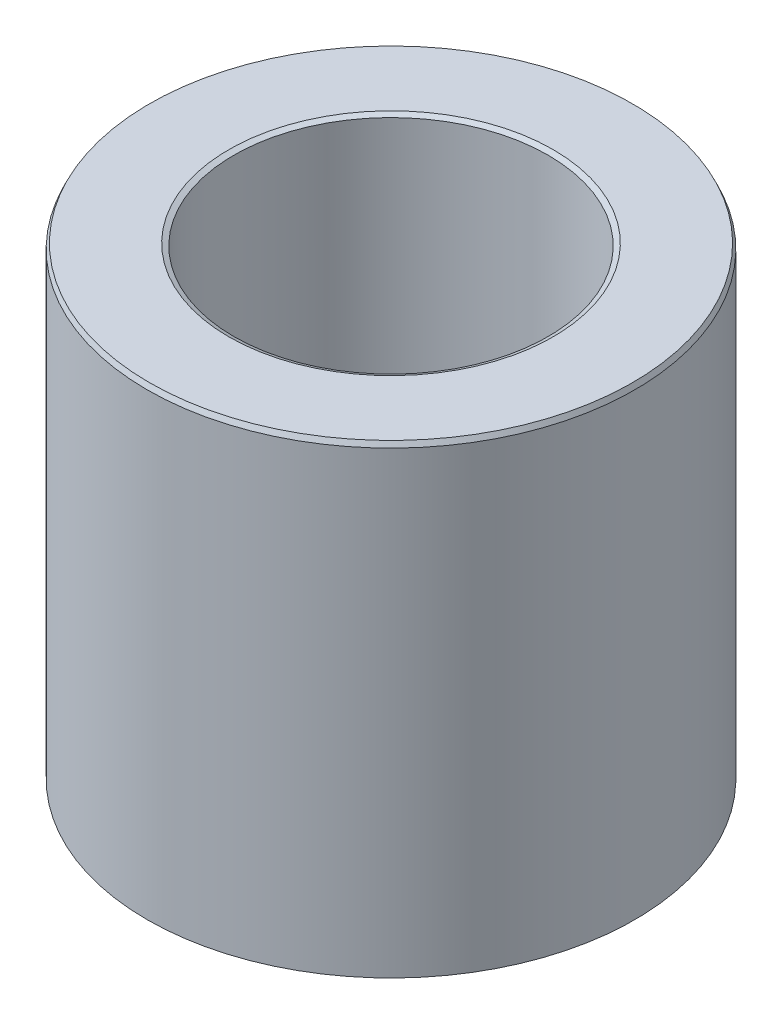
ISO-10303-21;
HEADER;
FILE_DESCRIPTION(('STEP AP214'),'2;1');
FILE_NAME('part.step','',(''),(''),'','','');
FILE_SCHEMA(('AUTOMOTIVE_DESIGN { 1 0 10303 214 1 1 1 1 }'));
ENDSEC;
DATA;
#1=APPLICATION_CONTEXT('core data for automotive mechanical design processes');
#2=APPLICATION_PROTOCOL_DEFINITION('international standard','automotive_design',2000,#1);
#3=PRODUCT_CONTEXT('',#1,'mechanical');
#4=PRODUCT('Part','Part','',(#3));
#5=PRODUCT_RELATED_PRODUCT_CATEGORY('part','',(#4));
#6=PRODUCT_DEFINITION_FORMATION('','',#4);
#7=PRODUCT_DEFINITION_CONTEXT('part definition',#1,'design');
#8=PRODUCT_DEFINITION('design','',#6,#7);
#9=PRODUCT_DEFINITION_SHAPE('','',#8);
#10=(LENGTH_UNIT() NAMED_UNIT(*) SI_UNIT(.MILLI.,.METRE.));
#11=(NAMED_UNIT(*) PLANE_ANGLE_UNIT() SI_UNIT($,.RADIAN.));
#12=(NAMED_UNIT(*) SI_UNIT($,.STERADIAN.) SOLID_ANGLE_UNIT());
#13=UNCERTAINTY_MEASURE_WITH_UNIT(LENGTH_MEASURE(1.E-05),#10,'distance_accuracy_value','');
#14=(GEOMETRIC_REPRESENTATION_CONTEXT(3) GLOBAL_UNCERTAINTY_ASSIGNED_CONTEXT((#13)) GLOBAL_UNIT_ASSIGNED_CONTEXT((#10,
#11,#12)) REPRESENTATION_CONTEXT('',''));
#15=CARTESIAN_POINT('',(0.,0.,0.));
#16=DIRECTION('',(0.,0.,1.));
#17=DIRECTION('',(1.,0.,0.));
#18=AXIS2_PLACEMENT_3D('',#15,#16,#17);
#19=CARTESIAN_POINT('',(0.,71.7025831738395,0.));
#20=DIRECTION('',(0.,-1.,0.));
#21=DIRECTION('',(0.,0.,-1.));
#22=AXIS2_PLACEMENT_3D('',#19,#20,#21);
#23=CYLINDRICAL_SURFACE('',#22,37.5);
#24=CARTESIAN_POINT('',(0.,0.352131170768377,0.));
#25=DIRECTION('',(0.,1.,0.));
#26=DIRECTION('',(0.,0.,1.));
#27=AXIS2_PLACEMENT_3D('',#24,#25,#26);
#28=CIRCLE('',#27,37.5);
#29=CARTESIAN_POINT('',(0.,0.352131170768377,37.5));
#30=VERTEX_POINT('',#29);
#31=EDGE_CURVE('E10',#30,#30,#28,.T.);
#32=ORIENTED_EDGE('',*,*,#31,.T.);
#33=EDGE_LOOP('',(#32));
#34=FACE_BOUND('',#33,.T.);
#35=CARTESIAN_POINT('',(0.,70.9270093020458,0.));
#36=DIRECTION('',(0.,1.,0.));
#37=DIRECTION('',(0.,0.,1.));
#38=AXIS2_PLACEMENT_3D('',#35,#36,#37);
#39=CIRCLE('',#38,37.5);
#40=CARTESIAN_POINT('',(0.,70.9270093020458,37.5));
#41=VERTEX_POINT('',#40);
#42=EDGE_CURVE('E50',#41,#41,#39,.F.);
#43=ORIENTED_EDGE('',*,*,#42,.T.);
#44=EDGE_LOOP('',(#43));
#45=FACE_BOUND('',#44,.T.);
#46=ADVANCED_FACE('F39',(#34,#45),#23,.T.);
#47=CARTESIAN_POINT('',(0.,71.7025831738395,0.));
#48=DIRECTION('',(0.,1.,0.));
#49=DIRECTION('',(0.,0.,1.));
#50=AXIS2_PLACEMENT_3D('',#47,#48,#49);
#51=PLANE('',#50);
#52=CARTESIAN_POINT('',(0.,71.7025831738395,0.));
#53=DIRECTION('',(0.,1.,0.));
#54=DIRECTION('',(0.,0.,1.));
#55=AXIS2_PLACEMENT_3D('',#52,#53,#54);
#56=CIRCLE('',#55,24.941851325434);
#57=CARTESIAN_POINT('',(0.,71.7025831738395,24.941851325434));
#58=VERTEX_POINT('',#57);
#59=EDGE_CURVE('E58',#58,#58,#56,.F.);
#60=ORIENTED_EDGE('',*,*,#59,.T.);
#61=EDGE_LOOP('',(#60));
#62=FACE_BOUND('',#61,.T.);
#63=CARTESIAN_POINT('',(0.,71.7025831738395,0.));
#64=DIRECTION('',(0.,1.,0.));
#65=DIRECTION('',(0.,0.,1.));
#66=AXIS2_PLACEMENT_3D('',#63,#64,#65);
#67=CIRCLE('',#66,37.1478688292316);
#68=CARTESIAN_POINT('',(0.,71.7025831738395,37.1478688292316));
#69=VERTEX_POINT('',#68);
#70=EDGE_CURVE('E61',#69,#69,#67,.T.);
#71=ORIENTED_EDGE('',*,*,#70,.T.);
#72=EDGE_LOOP('',(#71));
#73=FACE_BOUND('',#72,.T.);
#74=ADVANCED_FACE('F88',(#62,#73),#51,.T.);
#75=CARTESIAN_POINT('',(0.,0.,0.));
#76=DIRECTION('',(0.,1.,0.));
#77=DIRECTION('',(0.,0.,1.));
#78=AXIS2_PLACEMENT_3D('',#75,#76,#77);
#79=PLANE('',#78);
#80=CARTESIAN_POINT('',(0.,0.,0.));
#81=DIRECTION('',(0.,1.,0.));
#82=DIRECTION('',(0.,0.,1.));
#83=AXIS2_PLACEMENT_3D('',#80,#81,#82);
#84=CIRCLE('',#83,24.5184086244087);
#85=CARTESIAN_POINT('',(0.,0.,-24.5184086244087));
#86=VERTEX_POINT('',#85);
#87=EDGE_CURVE('E51',#86,#86,#84,.T.);
#88=ORIENTED_EDGE('',*,*,#87,.T.);
#89=EDGE_LOOP('',(#88));
#90=FACE_BOUND('',#89,.T.);
#91=CARTESIAN_POINT('',(0.,0.,0.));
#92=DIRECTION('',(0.,1.,0.));
#93=DIRECTION('',(0.,0.,1.));
#94=AXIS2_PLACEMENT_3D('',#91,#92,#93);
#95=CIRCLE('',#94,36.7244261282063);
#96=CARTESIAN_POINT('',(0.,0.,36.7244261282063));
#97=VERTEX_POINT('',#96);
#98=EDGE_CURVE('E54',#97,#97,#95,.F.);
#99=ORIENTED_EDGE('',*,*,#98,.T.);
#100=EDGE_LOOP('',(#99));
#101=FACE_BOUND('',#100,.T.);
#102=ADVANCED_FACE('F83',(#90,#101),#79,.F.);
#103=CARTESIAN_POINT('',(0.,71.7025831738395,0.));
#104=DIRECTION('',(0.,-1.,0.));
#105=DIRECTION('',(0.,0.,-1.));
#106=AXIS2_PLACEMENT_3D('',#103,#104,#105);
#107=CYLINDRICAL_SURFACE('',#106,24.1662774536403);
#108=CARTESIAN_POINT('',(0.,71.3504520030711,0.));
#109=DIRECTION('',(0.,1.,0.));
#110=DIRECTION('',(0.,0.,1.));
#111=AXIS2_PLACEMENT_3D('',#108,#109,#110);
#112=CIRCLE('',#111,24.1662774536403);
#113=CARTESIAN_POINT('',(0.,71.3504520030711,24.1662774536403));
#114=VERTEX_POINT('',#113);
#115=EDGE_CURVE('E67',#114,#114,#112,.T.);
#116=ORIENTED_EDGE('',*,*,#115,.T.);
#117=EDGE_LOOP('',(#116));
#118=FACE_BOUND('',#117,.T.);
#119=CARTESIAN_POINT('',(0.,0.77557387179375,0.));
#120=DIRECTION('',(0.,1.,0.));
#121=DIRECTION('',(0.,0.,1.));
#122=AXIS2_PLACEMENT_3D('',#119,#120,#121);
#123=CIRCLE('',#122,24.1662774536403);
#124=CARTESIAN_POINT('',(0.,0.77557387179375,-24.1662774536403));
#125=VERTEX_POINT('',#124);
#126=EDGE_CURVE('E69',#125,#125,#123,.F.);
#127=ORIENTED_EDGE('',*,*,#126,.T.);
#128=EDGE_LOOP('',(#127));
#129=FACE_BOUND('',#128,.T.);
#130=ADVANCED_FACE('F71',(#118,#129),#107,.F.);
#131=CARTESIAN_POINT('',(0.,71.3504520030711,0.));
#132=DIRECTION('',(0.,1.,0.));
#133=DIRECTION('',(0.,0.,1.));
#134=AXIS2_PLACEMENT_3D('',#131,#132,#133);
#135=CONICAL_SURFACE('',#134,24.1662774536403,1.14459892440019);
#136=ORIENTED_EDGE('',*,*,#59,.F.);
#137=EDGE_LOOP('',(#136));
#138=FACE_BOUND('',#137,.T.);
#139=ORIENTED_EDGE('',*,*,#115,.F.);
#140=EDGE_LOOP('',(#139));
#141=FACE_BOUND('',#140,.T.);
#142=ADVANCED_FACE('F77',(#138,#141),#135,.F.);
#143=CARTESIAN_POINT('',(0.,0.,0.));
#144=DIRECTION('',(0.,-1.,0.));
#145=DIRECTION('',(0.,0.,-1.));
#146=AXIS2_PLACEMENT_3D('',#143,#144,#145);
#147=CONICAL_SURFACE('',#146,24.5184086244087,0.426197402394692);
#148=CARTESIAN_POINT('',(0.,0.77557387179375,-24.1662774536403));
#149=CARTESIAN_POINT('',(0.,0.767494977295898,-24.1699454866692));
#150=CARTESIAN_POINT('',(0.,0.759416082798047,-24.173613519698));
#151=CARTESIAN_POINT('',(0.,0.743258293802344,-24.1809495857557));
#152=CARTESIAN_POINT('',(0.,0.735179399304492,-24.1846176187845));
#153=CARTESIAN_POINT('',(0.,0.719021610308789,-24.1919536848422));
#154=CARTESIAN_POINT('',(0.,0.710942715810937,-24.195621717871));
#155=CARTESIAN_POINT('',(0.,0.694784926815234,-24.2029577839287));
#156=CARTESIAN_POINT('',(0.,0.686706032317382,-24.2066258169575));
#157=CARTESIAN_POINT('',(0.,0.670548243321679,-24.2139618830152));
#158=CARTESIAN_POINT('',(0.,0.662469348823828,-24.2176299160441));
#159=CARTESIAN_POINT('',(0.,0.646311559828125,-24.2249659821017));
#160=CARTESIAN_POINT('',(0.,0.638232665330273,-24.2286340151306));
#161=CARTESIAN_POINT('',(0.,0.62207487633457,-24.2359700811882));
#162=CARTESIAN_POINT('',(0.,0.613995981836719,-24.2396381142171));
#163=CARTESIAN_POINT('',(0.,0.597838192841015,-24.2469741802748));
#164=CARTESIAN_POINT('',(0.,0.589759298343164,-24.2506422133036));
#165=CARTESIAN_POINT('',(0.,0.573601509347461,-24.2579782793613));
#166=CARTESIAN_POINT('',(0.,0.565522614849609,-24.2616463123901));
#167=CARTESIAN_POINT('',(0.,0.549364825853906,-24.2689823784478));
#168=CARTESIAN_POINT('',(0.,0.541285931356055,-24.2726504114766));
#169=CARTESIAN_POINT('',(0.,0.525128142360351,-24.2799864775343));
#170=CARTESIAN_POINT('',(0.,0.5170492478625,-24.2836545105631));
#171=CARTESIAN_POINT('',(0.,0.500891458866797,-24.2909905766208));
#172=CARTESIAN_POINT('',(0.,0.492812564368945,-24.2946586096496));
#173=CARTESIAN_POINT('',(0.,0.476654775373242,-24.3019946757073));
#174=CARTESIAN_POINT('',(0.,0.468575880875391,-24.3056627087362));
#175=CARTESIAN_POINT('',(0.,0.452418091879687,-24.3129987747938));
#176=CARTESIAN_POINT('',(0.,0.444339197381836,-24.3166668078227));
#177=CARTESIAN_POINT('',(0.,0.428181408386133,-24.3240028738803));
#178=CARTESIAN_POINT('',(0.,0.420102513888281,-24.3276709069092));
#179=CARTESIAN_POINT('',(0.,0.403944724892578,-24.3350069729669));
#180=CARTESIAN_POINT('',(0.,0.395865830394726,-24.3386750059957));
#181=CARTESIAN_POINT('',(0.,0.379708041399023,-24.3460110720534));
#182=CARTESIAN_POINT('',(0.,0.371629146901172,-24.3496791050822));
#183=CARTESIAN_POINT('',(0.,0.355471357905469,-24.3570151711399));
#184=CARTESIAN_POINT('',(0.,0.347392463407617,-24.3606832041687));
#185=CARTESIAN_POINT('',(0.,0.331234674411914,-24.3680192702264));
#186=CARTESIAN_POINT('',(0.,0.323155779914062,-24.3716873032552));
#187=CARTESIAN_POINT('',(0.,0.306997990918359,-24.3790233693129));
#188=CARTESIAN_POINT('',(0.,0.298919096420507,-24.3826914023417));
#189=CARTESIAN_POINT('',(0.,0.282761307424804,-24.3900274683994));
#190=CARTESIAN_POINT('',(0.,0.274682412926953,-24.3936955014283));
#191=CARTESIAN_POINT('',(0.,0.25852462393125,-24.4010315674859));
#192=CARTESIAN_POINT('',(0.,0.250445729433398,-24.4046996005148));
#193=CARTESIAN_POINT('',(0.,0.234287940437695,-24.4120356665724));
#194=CARTESIAN_POINT('',(0.,0.226209045939844,-24.4157036996013));
#195=CARTESIAN_POINT('',(0.,0.210051256944141,-24.423039765659));
#196=CARTESIAN_POINT('',(0.,0.201972362446289,-24.4267077986878));
#197=CARTESIAN_POINT('',(0.,0.185814573450586,-24.4340438647455));
#198=CARTESIAN_POINT('',(0.,0.177735678952734,-24.4377118977743));
#199=CARTESIAN_POINT('',(0.,0.161577889957031,-24.445047963832));
#200=CARTESIAN_POINT('',(0.,0.15349899545918,-24.4487159968608));
#201=CARTESIAN_POINT('',(0.,0.137341206463476,-24.4560520629185));
#202=CARTESIAN_POINT('',(0.,0.129262311965625,-24.4597200959473));
#203=CARTESIAN_POINT('',(0.,0.113104522969922,-24.467056162005));
#204=CARTESIAN_POINT('',(0.,0.10502562847207,-24.4707241950338));
#205=CARTESIAN_POINT('',(0.,0.0888678394763674,-24.4780602610915));
#206=CARTESIAN_POINT('',(0.,0.0807889449785157,-24.4817282941204));
#207=CARTESIAN_POINT('',(0.,0.0646311559828124,-24.489064360178));
#208=CARTESIAN_POINT('',(0.,0.0565522614849609,-24.4927323932069));
#209=CARTESIAN_POINT('',(0.,0.0403944724892578,-24.5000684592645));
#210=CARTESIAN_POINT('',(0.,0.0323155779914062,-24.5037364922934));
#211=CARTESIAN_POINT('',(0.,0.0161577889957031,-24.5110725583511));
#212=CARTESIAN_POINT('',(0.,0.00807889449785155,-24.5147405913799));
#213=CARTESIAN_POINT('',(0.,0.,-24.5184086244087));
#214=B_SPLINE_CURVE_WITH_KNOTS('',3,(#148,#149,#150,#151,#152,#153,#154,#155,#156,#157,#158,
#159,#160,#161,#162,#163,#164,#165,#166,#167,#168,#169,#170,#171,#172,#173,#174,#175,#176,#177,
#178,#179,#180,#181,#182,#183,#184,#185,#186,#187,#188,#189,#190,#191,#192,#193,#194,#195,#196,
#197,#198,#199,#200,#201,#202,#203,#204,#205,#206,#207,#208,#209,#210,#211,#212,#213),
.UNSPECIFIED.,.F.,.F.,(4,2,2,2,2,2,2,2,2,2,2,2,2,2,2,2,2,2,2,2,2,2,2,2,2,2,2,2,2,2,2,2,4),(0.,
0.0266177952406377,0.0532355904812754,0.0798533857219131,0.106471180962551,0.13308897620319,
0.159706771443828,0.186324566684465,0.212942361925103,0.239560157165741,0.266177952406379,
0.292795747647016,0.319413542887655,0.346031338128293,0.372649133368931,0.399266928609569,
0.425884723850206,0.452502519090844,0.479120314331482,0.505738109572119,0.532355904812757,
0.558973700053396,0.585591495294034,0.612209290534672,0.638827085775309,0.665444881015947,
0.692062676256585,0.718680471497223,0.745298266737862,0.771916061978499,0.798533857219137,
0.825151652459775,0.851769447700413),.UNSPECIFIED.);
#215=EDGE_CURVE('BSEAM73',#125,#86,#214,.T.);
#216=ORIENTED_EDGE('',*,*,#126,.F.);
#217=ORIENTED_EDGE('',*,*,#87,.F.);
#218=ORIENTED_EDGE('',*,*,#215,.T.);
#219=ORIENTED_EDGE('',*,*,#215,.F.);
#220=EDGE_LOOP('',(#216,#218,#217,#219));
#221=FACE_BOUND('',#220,.T.);
#222=ADVANCED_FACE('F73',(#221),#147,.F.);
#223=CARTESIAN_POINT('',(0.,0.352131170768377,0.));
#224=DIRECTION('',(0.,1.,0.));
#225=DIRECTION('',(0.,0.,1.));
#226=AXIS2_PLACEMENT_3D('',#223,#224,#225);
#227=CONICAL_SURFACE('',#226,37.5,1.1445989244002);
#228=ORIENTED_EDGE('',*,*,#98,.F.);
#229=EDGE_LOOP('',(#228));
#230=FACE_BOUND('',#229,.T.);
#231=ORIENTED_EDGE('',*,*,#31,.F.);
#232=EDGE_LOOP('',(#231));
#233=FACE_BOUND('',#232,.T.);
#234=ADVANCED_FACE('F76',(#230,#233),#227,.T.);
#235=CARTESIAN_POINT('',(0.,71.7025831738395,0.));
#236=DIRECTION('',(0.,-1.,0.));
#237=DIRECTION('',(0.,0.,-1.));
#238=AXIS2_PLACEMENT_3D('',#235,#236,#237);
#239=CONICAL_SURFACE('',#238,37.1478688292316,0.426197402394703);
#240=ORIENTED_EDGE('',*,*,#42,.F.);
#241=EDGE_LOOP('',(#240));
#242=FACE_BOUND('',#241,.T.);
#243=ORIENTED_EDGE('',*,*,#70,.F.);
#244=EDGE_LOOP('',(#243));
#245=FACE_BOUND('',#244,.T.);
#246=ADVANCED_FACE('F45',(#242,#245),#239,.T.);
#247=CLOSED_SHELL('',(#46,#74,#102,#130,#142,#222,#234,#246));
#248=MANIFOLD_SOLID_BREP('B2',#247);
#249=ADVANCED_BREP_SHAPE_REPRESENTATION('',(#18,#248),#14);
#250=SHAPE_DEFINITION_REPRESENTATION(#9,#249);
ENDSEC;
END-ISO-10303-21;
